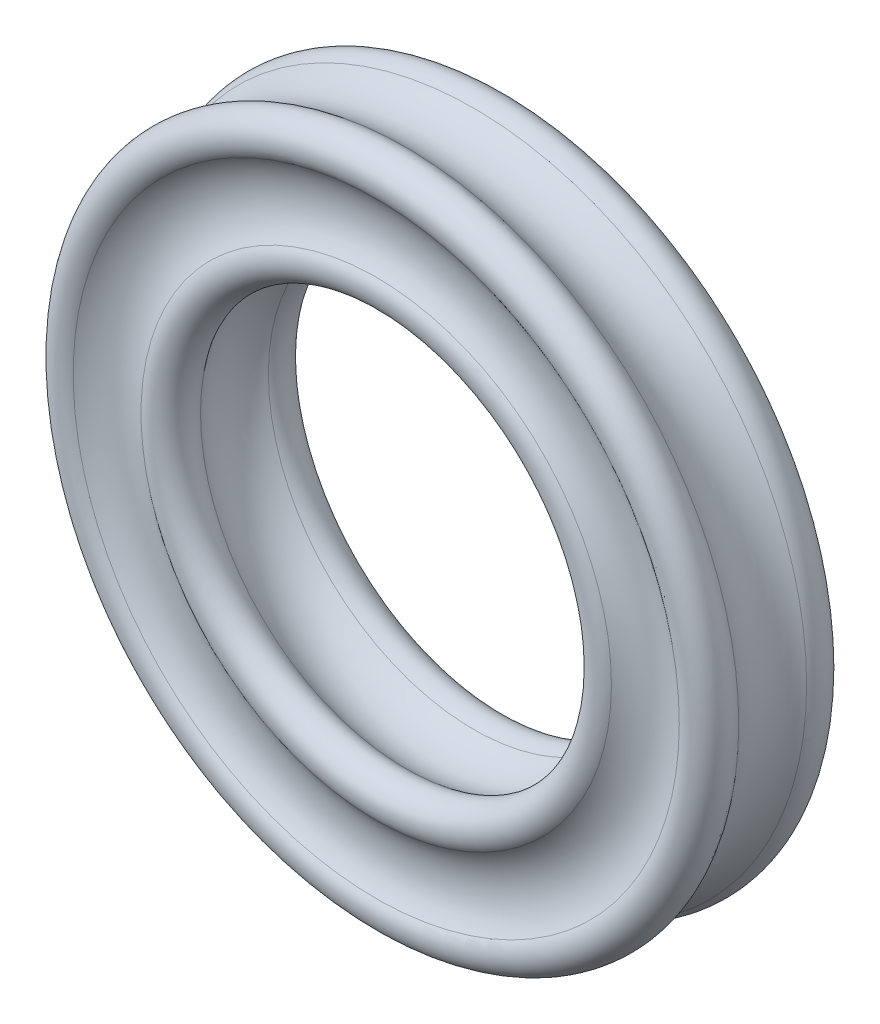
ISO-10303-21;
HEADER;
FILE_DESCRIPTION(('STEP AP214'),'2;1');
FILE_NAME('part.step','',(''),(''),'','','');
FILE_SCHEMA(('AUTOMOTIVE_DESIGN { 1 0 10303 214 1 1 1 1 }'));
ENDSEC;
DATA;
#1=APPLICATION_CONTEXT('core data for automotive mechanical design processes');
#2=APPLICATION_PROTOCOL_DEFINITION('international standard','automotive_design',2000,#1);
#3=PRODUCT_CONTEXT('',#1,'mechanical');
#4=PRODUCT('Part','Part','',(#3));
#5=PRODUCT_RELATED_PRODUCT_CATEGORY('part','',(#4));
#6=PRODUCT_DEFINITION_FORMATION('','',#4);
#7=PRODUCT_DEFINITION_CONTEXT('part definition',#1,'design');
#8=PRODUCT_DEFINITION('design','',#6,#7);
#9=PRODUCT_DEFINITION_SHAPE('','',#8);
#10=(LENGTH_UNIT() NAMED_UNIT(*) SI_UNIT(.MILLI.,.METRE.));
#11=(NAMED_UNIT(*) PLANE_ANGLE_UNIT() SI_UNIT($,.RADIAN.));
#12=(NAMED_UNIT(*) SI_UNIT($,.STERADIAN.) SOLID_ANGLE_UNIT());
#13=UNCERTAINTY_MEASURE_WITH_UNIT(LENGTH_MEASURE(1.E-05),#10,'distance_accuracy_value','');
#14=(GEOMETRIC_REPRESENTATION_CONTEXT(3) GLOBAL_UNCERTAINTY_ASSIGNED_CONTEXT((#13)) GLOBAL_UNIT_ASSIGNED_CONTEXT((#10,
#11,#12)) REPRESENTATION_CONTEXT('',''));
#15=CARTESIAN_POINT('',(0.,0.,0.));
#16=DIRECTION('',(0.,0.,1.));
#17=DIRECTION('',(1.,0.,0.));
#18=AXIS2_PLACEMENT_3D('',#15,#16,#17);
#19=CARTESIAN_POINT('',(0.,0.,-1.97238052947636));
#20=DIRECTION('',(0.,0.,1.));
#21=DIRECTION('',(1.,0.,0.));
#22=AXIS2_PLACEMENT_3D('',#19,#20,#21);
#23=TOROIDAL_SURFACE('',#22,5.1,1.);
#24=CARTESIAN_POINT('',(0.,0.,-1.20639443699325));
#25=DIRECTION('',(0.,0.,1.));
#26=DIRECTION('',(1.,0.,0.));
#27=AXIS2_PLACEMENT_3D('',#24,#25,#26);
#28=CIRCLE('',#27,5.74285714285714);
#29=CARTESIAN_POINT('',(5.74285714285714,0.,-1.20639443699325));
#30=VERTEX_POINT('',#29);
#31=EDGE_CURVE('E59',#30,#30,#28,.T.);
#32=ORIENTED_EDGE('',*,*,#31,.F.);
#33=EDGE_LOOP('',(#32));
#34=FACE_BOUND('',#33,.T.);
#35=CARTESIAN_POINT('',(0.,0.,-1.20639443699325));
#36=DIRECTION('',(0.,0.,1.));
#37=DIRECTION('',(1.,0.,0.));
#38=AXIS2_PLACEMENT_3D('',#35,#36,#37);
#39=CIRCLE('',#38,4.45714285714286);
#40=CARTESIAN_POINT('',(4.45714285714286,0.,-1.20639443699325));
#41=VERTEX_POINT('',#40);
#42=EDGE_CURVE('E56',#41,#41,#39,.T.);
#43=ORIENTED_EDGE('',*,*,#42,.T.);
#44=EDGE_LOOP('',(#43));
#45=FACE_BOUND('',#44,.T.);
#46=ADVANCED_FACE('F33',(#34,#45),#23,.F.);
#47=CARTESIAN_POINT('',(0.,0.,-0.9));
#48=DIRECTION('',(0.,0.,1.));
#49=DIRECTION('',(1.,0.,0.));
#50=AXIS2_PLACEMENT_3D('',#47,#48,#49);
#51=TOROIDAL_SURFACE('',#50,6.,0.4);
#52=ORIENTED_EDGE('',*,*,#31,.T.);
#53=EDGE_LOOP('',(#52));
#54=FACE_BOUND('',#53,.T.);
#55=CARTESIAN_POINT('',(0.,0.,-0.642857142857143));
#56=DIRECTION('',(0.,0.,1.));
#57=DIRECTION('',(1.,0.,0.));
#58=AXIS2_PLACEMENT_3D('',#55,#56,#57);
#59=CIRCLE('',#58,6.30639443699324);
#60=CARTESIAN_POINT('',(6.30639443699324,0.,-0.642857142857143));
#61=VERTEX_POINT('',#60);
#62=EDGE_CURVE('E62',#61,#61,#59,.T.);
#63=ORIENTED_EDGE('',*,*,#62,.F.);
#64=EDGE_LOOP('',(#63));
#65=FACE_BOUND('',#64,.T.);
#66=ADVANCED_FACE('F68',(#54,#65),#51,.T.);
#67=CARTESIAN_POINT('',(0.,0.,0.));
#68=DIRECTION('',(0.,0.,1.));
#69=DIRECTION('',(1.,0.,0.));
#70=AXIS2_PLACEMENT_3D('',#67,#68,#69);
#71=TOROIDAL_SURFACE('',#70,7.07238052947636,1.);
#72=ORIENTED_EDGE('',*,*,#62,.T.);
#73=EDGE_LOOP('',(#72));
#74=FACE_BOUND('',#73,.T.);
#75=CARTESIAN_POINT('',(0.,0.,0.642857142857143));
#76=DIRECTION('',(0.,0.,1.));
#77=DIRECTION('',(1.,0.,0.));
#78=AXIS2_PLACEMENT_3D('',#75,#76,#77);
#79=CIRCLE('',#78,6.30639443699325);
#80=CARTESIAN_POINT('',(6.30639443699325,0.,0.642857142857143));
#81=VERTEX_POINT('',#80);
#82=EDGE_CURVE('E10',#81,#81,#79,.T.);
#83=ORIENTED_EDGE('',*,*,#82,.F.);
#84=EDGE_LOOP('',(#83));
#85=FACE_BOUND('',#84,.T.);
#86=ADVANCED_FACE('F35',(#74,#85),#71,.F.);
#87=CARTESIAN_POINT('',(0.,0.,-0.900000000000001));
#88=DIRECTION('',(0.,0.,1.));
#89=DIRECTION('',(1.,0.,0.));
#90=AXIS2_PLACEMENT_3D('',#87,#88,#89);
#91=TOROIDAL_SURFACE('',#90,4.2,0.4);
#92=ORIENTED_EDGE('',*,*,#42,.F.);
#93=EDGE_LOOP('',(#92));
#94=FACE_BOUND('',#93,.T.);
#95=CARTESIAN_POINT('',(0.,0.,-0.642857142857143));
#96=DIRECTION('',(0.,0.,1.));
#97=DIRECTION('',(1.,0.,0.));
#98=AXIS2_PLACEMENT_3D('',#95,#96,#97);
#99=CIRCLE('',#98,3.89360556300675);
#100=CARTESIAN_POINT('',(3.89360556300675,0.,-0.642857142857143));
#101=VERTEX_POINT('',#100);
#102=EDGE_CURVE('E53',#101,#101,#99,.T.);
#103=ORIENTED_EDGE('',*,*,#102,.T.);
#104=EDGE_LOOP('',(#103));
#105=FACE_BOUND('',#104,.T.);
#106=ADVANCED_FACE('F76',(#94,#105),#91,.T.);
#107=CARTESIAN_POINT('',(0.,0.,0.));
#108=DIRECTION('',(0.,0.,1.));
#109=DIRECTION('',(1.,0.,0.));
#110=AXIS2_PLACEMENT_3D('',#107,#108,#109);
#111=TOROIDAL_SURFACE('',#110,3.12761947052364,1.);
#112=ORIENTED_EDGE('',*,*,#102,.F.);
#113=EDGE_LOOP('',(#112));
#114=FACE_BOUND('',#113,.T.);
#115=CARTESIAN_POINT('',(0.,0.,0.642857142857143));
#116=DIRECTION('',(0.,0.,1.));
#117=DIRECTION('',(1.,0.,0.));
#118=AXIS2_PLACEMENT_3D('',#115,#116,#117);
#119=CIRCLE('',#118,3.89360556300675);
#120=CARTESIAN_POINT('',(3.89360556300675,0.,0.642857142857143));
#121=VERTEX_POINT('',#120);
#122=EDGE_CURVE('E48',#121,#121,#119,.T.);
#123=ORIENTED_EDGE('',*,*,#122,.T.);
#124=EDGE_LOOP('',(#123));
#125=FACE_BOUND('',#124,.T.);
#126=ADVANCED_FACE('F82',(#114,#125),#111,.F.);
#127=CARTESIAN_POINT('',(0.,0.,0.9));
#128=DIRECTION('',(0.,0.,1.));
#129=DIRECTION('',(1.,0.,0.));
#130=AXIS2_PLACEMENT_3D('',#127,#128,#129);
#131=TOROIDAL_SURFACE('',#130,4.2,0.4);
#132=ORIENTED_EDGE('',*,*,#122,.F.);
#133=EDGE_LOOP('',(#132));
#134=FACE_BOUND('',#133,.T.);
#135=CARTESIAN_POINT('',(0.,0.,1.20639443699325));
#136=DIRECTION('',(0.,0.,1.));
#137=DIRECTION('',(1.,0.,0.));
#138=AXIS2_PLACEMENT_3D('',#135,#136,#137);
#139=CIRCLE('',#138,4.45714285714286);
#140=CARTESIAN_POINT('',(4.45714285714286,0.,1.20639443699325));
#141=VERTEX_POINT('',#140);
#142=EDGE_CURVE('E44',#141,#141,#139,.T.);
#143=ORIENTED_EDGE('',*,*,#142,.T.);
#144=EDGE_LOOP('',(#143));
#145=FACE_BOUND('',#144,.T.);
#146=ADVANCED_FACE('F86',(#134,#145),#131,.T.);
#147=CARTESIAN_POINT('',(0.,0.,1.97238052947636));
#148=DIRECTION('',(0.,0.,1.));
#149=DIRECTION('',(1.,0.,0.));
#150=AXIS2_PLACEMENT_3D('',#147,#148,#149);
#151=TOROIDAL_SURFACE('',#150,5.1,1.);
#152=CARTESIAN_POINT('',(0.,0.,1.20639443699325));
#153=DIRECTION('',(0.,0.,1.));
#154=DIRECTION('',(1.,0.,0.));
#155=AXIS2_PLACEMENT_3D('',#152,#153,#154);
#156=CIRCLE('',#155,5.74285714285714);
#157=CARTESIAN_POINT('',(5.74285714285714,0.,1.20639443699325));
#158=VERTEX_POINT('',#157);
#159=EDGE_CURVE('E40',#158,#158,#156,.T.);
#160=ORIENTED_EDGE('',*,*,#159,.T.);
#161=EDGE_LOOP('',(#160));
#162=FACE_BOUND('',#161,.T.);
#163=ORIENTED_EDGE('',*,*,#142,.F.);
#164=EDGE_LOOP('',(#163));
#165=FACE_BOUND('',#164,.T.);
#166=ADVANCED_FACE('F90',(#162,#165),#151,.F.);
#167=CARTESIAN_POINT('',(0.,0.,0.9));
#168=DIRECTION('',(0.,0.,1.));
#169=DIRECTION('',(1.,0.,0.));
#170=AXIS2_PLACEMENT_3D('',#167,#168,#169);
#171=TOROIDAL_SURFACE('',#170,6.,0.4);
#172=ORIENTED_EDGE('',*,*,#159,.F.);
#173=EDGE_LOOP('',(#172));
#174=FACE_BOUND('',#173,.T.);
#175=ORIENTED_EDGE('',*,*,#82,.T.);
#176=EDGE_LOOP('',(#175));
#177=FACE_BOUND('',#176,.T.);
#178=ADVANCED_FACE('F93',(#174,#177),#171,.T.);
#179=CLOSED_SHELL('',(#46,#66,#86,#106,#126,#146,#166,#178));
#180=MANIFOLD_SOLID_BREP('B2',#179);
#181=ADVANCED_BREP_SHAPE_REPRESENTATION('',(#18,#180),#14);
#182=SHAPE_DEFINITION_REPRESENTATION(#9,#181);
ENDSEC;
END-ISO-10303-21;
